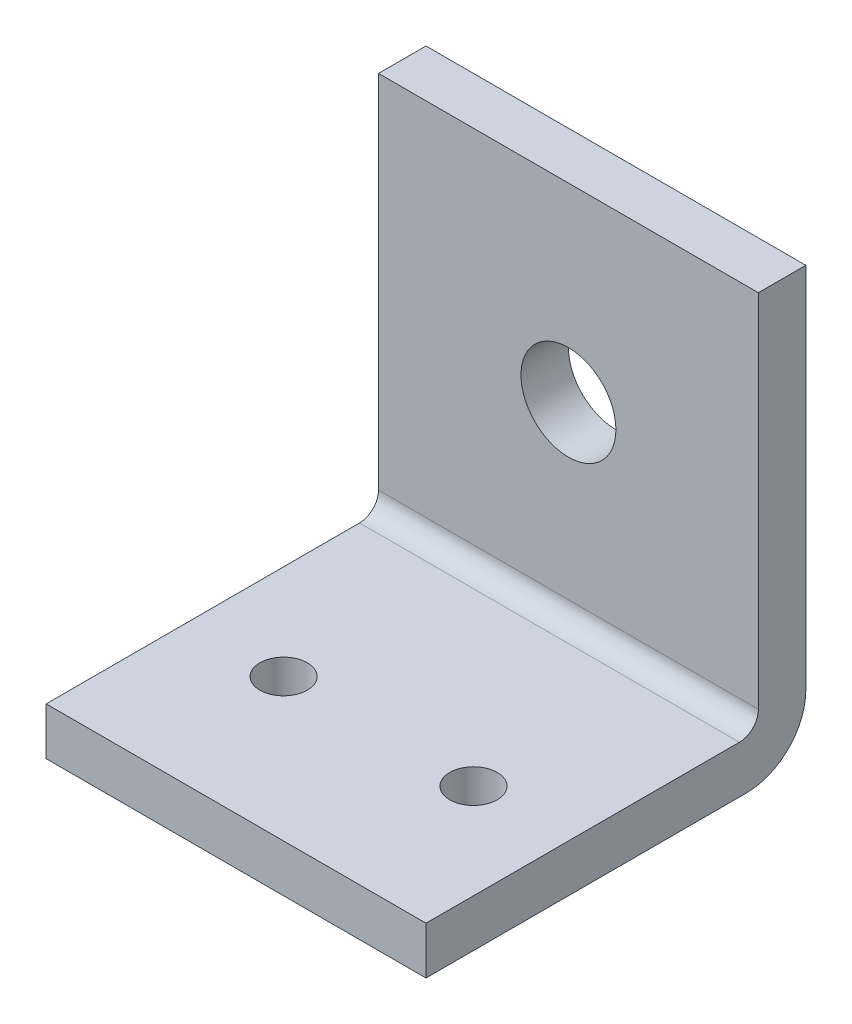
ISO-10303-21;
HEADER;
FILE_DESCRIPTION(('STEP AP214'),'2;1');
FILE_NAME('part.step','',(''),(''),'','','');
FILE_SCHEMA(('AUTOMOTIVE_DESIGN { 1 0 10303 214 1 1 1 1 }'));
ENDSEC;
DATA;
#1=APPLICATION_CONTEXT('core data for automotive mechanical design processes');
#2=APPLICATION_PROTOCOL_DEFINITION('international standard','automotive_design',2000,#1);
#3=PRODUCT_CONTEXT('',#1,'mechanical');
#4=PRODUCT('Part','Part','',(#3));
#5=PRODUCT_RELATED_PRODUCT_CATEGORY('part','',(#4));
#6=PRODUCT_DEFINITION_FORMATION('','',#4);
#7=PRODUCT_DEFINITION_CONTEXT('part definition',#1,'design');
#8=PRODUCT_DEFINITION('design','',#6,#7);
#9=PRODUCT_DEFINITION_SHAPE('','',#8);
#10=(LENGTH_UNIT() NAMED_UNIT(*) SI_UNIT(.MILLI.,.METRE.));
#11=(NAMED_UNIT(*) PLANE_ANGLE_UNIT() SI_UNIT($,.RADIAN.));
#12=(NAMED_UNIT(*) SI_UNIT($,.STERADIAN.) SOLID_ANGLE_UNIT());
#13=UNCERTAINTY_MEASURE_WITH_UNIT(LENGTH_MEASURE(1.E-05),#10,'distance_accuracy_value','');
#14=(GEOMETRIC_REPRESENTATION_CONTEXT(3) GLOBAL_UNCERTAINTY_ASSIGNED_CONTEXT((#13)) GLOBAL_UNIT_ASSIGNED_CONTEXT((#10,
#11,#12)) REPRESENTATION_CONTEXT('',''));
#15=CARTESIAN_POINT('',(0.,0.,0.));
#16=DIRECTION('',(0.,0.,1.));
#17=DIRECTION('',(1.,0.,0.));
#18=AXIS2_PLACEMENT_3D('',#15,#16,#17);
#19=CARTESIAN_POINT('',(0.,5.,40.));
#20=DIRECTION('',(0.,-1.,0.));
#21=DIRECTION('',(0.,0.,-1.));
#22=AXIS2_PLACEMENT_3D('',#19,#20,#21);
#23=PLANE('',#22);
#24=CARTESIAN_POINT('',(10.,5.,25.));
#25=DIRECTION('',(0.,1.,0.));
#26=DIRECTION('',(0.,0.,1.));
#27=AXIS2_PLACEMENT_3D('',#24,#25,#26);
#28=CIRCLE('',#27,2.5);
#29=CARTESIAN_POINT('',(10.,5.,27.5));
#30=VERTEX_POINT('',#29);
#31=EDGE_CURVE('E182',#30,#30,#28,.T.);
#32=ORIENTED_EDGE('',*,*,#31,.F.);
#33=EDGE_LOOP('',(#32));
#34=FACE_BOUND('',#33,.T.);
#35=CARTESIAN_POINT('',(30.,5.,25.));
#36=DIRECTION('',(0.,1.,0.));
#37=DIRECTION('',(0.,0.,1.));
#38=AXIS2_PLACEMENT_3D('',#35,#36,#37);
#39=CIRCLE('',#38,2.5);
#40=CARTESIAN_POINT('',(30.,5.,27.5));
#41=VERTEX_POINT('',#40);
#42=EDGE_CURVE('E204',#41,#41,#39,.T.);
#43=ORIENTED_EDGE('',*,*,#42,.F.);
#44=EDGE_LOOP('',(#43));
#45=FACE_BOUND('',#44,.T.);
#46=DIRECTION('',(0.,0.,-1.));
#47=VECTOR('',#46,1.);
#48=CARTESIAN_POINT('',(40.,5.,40.));
#49=LINE('',#48,#47);
#50=CARTESIAN_POINT('',(40.,5.,40.));
#51=VERTEX_POINT('',#50);
#52=CARTESIAN_POINT('',(40.,5.,7.));
#53=VERTEX_POINT('',#52);
#54=EDGE_CURVE('E166',#51,#53,#49,.T.);
#55=ORIENTED_EDGE('',*,*,#54,.T.);
#56=DIRECTION('',(1.,0.,0.));
#57=VECTOR('',#56,1.);
#58=CARTESIAN_POINT('',(0.,5.,7.));
#59=LINE('',#58,#57);
#60=CARTESIAN_POINT('',(0.,5.,7.));
#61=VERTEX_POINT('',#60);
#62=EDGE_CURVE('E65',#53,#61,#59,.F.);
#63=ORIENTED_EDGE('',*,*,#62,.T.);
#64=DIRECTION('',(0.,0.,-1.));
#65=VECTOR('',#64,1.);
#66=CARTESIAN_POINT('',(0.,5.,40.));
#67=LINE('',#66,#65);
#68=CARTESIAN_POINT('',(0.,5.,40.));
#69=VERTEX_POINT('',#68);
#70=EDGE_CURVE('E160',#69,#61,#67,.T.);
#71=ORIENTED_EDGE('',*,*,#70,.F.);
#72=DIRECTION('',(-1.,0.,0.));
#73=VECTOR('',#72,1.);
#74=CARTESIAN_POINT('',(0.,5.,40.));
#75=LINE('',#74,#73);
#76=EDGE_CURVE('E158',#51,#69,#75,.T.);
#77=ORIENTED_EDGE('',*,*,#76,.F.);
#78=EDGE_LOOP('',(#55,#63,#71,#77));
#79=FACE_BOUND('',#78,.T.);
#80=ADVANCED_FACE('F43',(#34,#45,#79),#23,.F.);
#81=CARTESIAN_POINT('',(0.,0.,40.));
#82=DIRECTION('',(1.,0.,0.));
#83=DIRECTION('',(0.,0.,-1.));
#84=AXIS2_PLACEMENT_3D('',#81,#82,#83);
#85=PLANE('',#84);
#86=DIRECTION('',(0.,-1.,0.));
#87=VECTOR('',#86,1.);
#88=CARTESIAN_POINT('',(0.,0.,0.));
#89=LINE('',#88,#87);
#90=CARTESIAN_POINT('',(0.,45.,0.));
#91=VERTEX_POINT('',#90);
#92=CARTESIAN_POINT('',(0.,6.25,0.));
#93=VERTEX_POINT('',#92);
#94=EDGE_CURVE('E137',#91,#93,#89,.T.);
#95=ORIENTED_EDGE('',*,*,#94,.T.);
#96=CARTESIAN_POINT('',(0.,6.25,6.25));
#97=DIRECTION('',(1.,0.,0.));
#98=DIRECTION('',(0.,0.,-1.));
#99=AXIS2_PLACEMENT_3D('',#96,#97,#98);
#100=CIRCLE('',#99,6.25);
#101=CARTESIAN_POINT('',(0.,0.,6.25));
#102=VERTEX_POINT('',#101);
#103=EDGE_CURVE('E195',#93,#102,#100,.F.);
#104=ORIENTED_EDGE('',*,*,#103,.T.);
#105=DIRECTION('',(0.,0.,-1.));
#106=VECTOR('',#105,1.);
#107=CARTESIAN_POINT('',(0.,0.,40.));
#108=LINE('',#107,#106);
#109=CARTESIAN_POINT('',(0.,0.,40.));
#110=VERTEX_POINT('',#109);
#111=EDGE_CURVE('E173',#110,#102,#108,.T.);
#112=ORIENTED_EDGE('',*,*,#111,.F.);
#113=DIRECTION('',(0.,-1.,0.));
#114=VECTOR('',#113,1.);
#115=CARTESIAN_POINT('',(0.,0.,40.));
#116=LINE('',#115,#114);
#117=EDGE_CURVE('E148',#69,#110,#116,.T.);
#118=ORIENTED_EDGE('',*,*,#117,.F.);
#119=ORIENTED_EDGE('',*,*,#70,.T.);
#120=CARTESIAN_POINT('',(0.,7.,7.));
#121=DIRECTION('',(1.,0.,0.));
#122=DIRECTION('',(0.,0.,-1.));
#123=AXIS2_PLACEMENT_3D('',#120,#121,#122);
#124=CIRCLE('',#123,2.);
#125=CARTESIAN_POINT('',(0.,7.,5.));
#126=VERTEX_POINT('',#125);
#127=EDGE_CURVE('E11',#61,#126,#124,.T.);
#128=ORIENTED_EDGE('',*,*,#127,.T.);
#129=DIRECTION('',(0.,-1.,0.));
#130=VECTOR('',#129,1.);
#131=CARTESIAN_POINT('',(0.,45.,5.));
#132=LINE('',#131,#130);
#133=CARTESIAN_POINT('',(0.,45.,5.));
#134=VERTEX_POINT('',#133);
#135=EDGE_CURVE('E114',#134,#126,#132,.T.);
#136=ORIENTED_EDGE('',*,*,#135,.F.);
#137=DIRECTION('',(0.,0.,1.));
#138=VECTOR('',#137,1.);
#139=CARTESIAN_POINT('',(0.,45.,0.));
#140=LINE('',#139,#138);
#141=EDGE_CURVE('E122',#91,#134,#140,.T.);
#142=ORIENTED_EDGE('',*,*,#141,.F.);
#143=EDGE_LOOP('',(#95,#104,#112,#118,#119,#128,#136,#142));
#144=FACE_BOUND('',#143,.T.);
#145=ADVANCED_FACE('F134',(#144),#85,.F.);
#146=CARTESIAN_POINT('',(0.,0.,40.));
#147=DIRECTION('',(0.,1.,0.));
#148=DIRECTION('',(0.,0.,1.));
#149=AXIS2_PLACEMENT_3D('',#146,#147,#148);
#150=PLANE('',#149);
#151=CARTESIAN_POINT('',(10.,0.,25.));
#152=DIRECTION('',(0.,1.,0.));
#153=DIRECTION('',(0.,0.,1.));
#154=AXIS2_PLACEMENT_3D('',#151,#152,#153);
#155=CIRCLE('',#154,2.5);
#156=CARTESIAN_POINT('',(10.,0.,27.5));
#157=VERTEX_POINT('',#156);
#158=EDGE_CURVE('E132',#157,#157,#155,.T.);
#159=ORIENTED_EDGE('',*,*,#158,.T.);
#160=EDGE_LOOP('',(#159));
#161=FACE_BOUND('',#160,.T.);
#162=CARTESIAN_POINT('',(30.,0.,25.));
#163=DIRECTION('',(0.,1.,0.));
#164=DIRECTION('',(0.,0.,1.));
#165=AXIS2_PLACEMENT_3D('',#162,#163,#164);
#166=CIRCLE('',#165,2.5);
#167=CARTESIAN_POINT('',(30.,0.,27.5));
#168=VERTEX_POINT('',#167);
#169=EDGE_CURVE('E178',#168,#168,#166,.T.);
#170=ORIENTED_EDGE('',*,*,#169,.T.);
#171=EDGE_LOOP('',(#170));
#172=FACE_BOUND('',#171,.T.);
#173=ORIENTED_EDGE('',*,*,#111,.T.);
#174=DIRECTION('',(1.,0.,0.));
#175=VECTOR('',#174,1.);
#176=CARTESIAN_POINT('',(40.,0.,6.25));
#177=LINE('',#176,#175);
#178=CARTESIAN_POINT('',(40.,0.,6.25));
#179=VERTEX_POINT('',#178);
#180=EDGE_CURVE('E177',#102,#179,#177,.T.);
#181=ORIENTED_EDGE('',*,*,#180,.T.);
#182=DIRECTION('',(0.,0.,-1.));
#183=VECTOR('',#182,1.);
#184=CARTESIAN_POINT('',(40.,0.,40.));
#185=LINE('',#184,#183);
#186=CARTESIAN_POINT('',(40.,0.,40.));
#187=VERTEX_POINT('',#186);
#188=EDGE_CURVE('E169',#187,#179,#185,.T.);
#189=ORIENTED_EDGE('',*,*,#188,.F.);
#190=DIRECTION('',(1.,0.,0.));
#191=VECTOR('',#190,1.);
#192=CARTESIAN_POINT('',(0.,0.,40.));
#193=LINE('',#192,#191);
#194=EDGE_CURVE('E152',#110,#187,#193,.T.);
#195=ORIENTED_EDGE('',*,*,#194,.F.);
#196=EDGE_LOOP('',(#173,#181,#189,#195));
#197=FACE_BOUND('',#196,.T.);
#198=ADVANCED_FACE('F242',(#161,#172,#197),#150,.F.);
#199=CARTESIAN_POINT('',(40.,0.,40.));
#200=DIRECTION('',(-1.,0.,0.));
#201=DIRECTION('',(0.,0.,1.));
#202=AXIS2_PLACEMENT_3D('',#199,#200,#201);
#203=PLANE('',#202);
#204=ORIENTED_EDGE('',*,*,#188,.T.);
#205=CARTESIAN_POINT('',(40.,6.25,6.25));
#206=DIRECTION('',(-1.,0.,0.));
#207=DIRECTION('',(0.,0.,1.));
#208=AXIS2_PLACEMENT_3D('',#205,#206,#207);
#209=CIRCLE('',#208,6.25);
#210=CARTESIAN_POINT('',(40.,6.25,0.));
#211=VERTEX_POINT('',#210);
#212=EDGE_CURVE('E189',#179,#211,#209,.F.);
#213=ORIENTED_EDGE('',*,*,#212,.T.);
#214=DIRECTION('',(0.,1.,0.));
#215=VECTOR('',#214,1.);
#216=CARTESIAN_POINT('',(40.,0.,0.));
#217=LINE('',#216,#215);
#218=CARTESIAN_POINT('',(40.,45.,0.));
#219=VERTEX_POINT('',#218);
#220=EDGE_CURVE('E142',#211,#219,#217,.T.);
#221=ORIENTED_EDGE('',*,*,#220,.T.);
#222=DIRECTION('',(0.,0.,-1.));
#223=VECTOR('',#222,1.);
#224=CARTESIAN_POINT('',(40.,45.,0.));
#225=LINE('',#224,#223);
#226=CARTESIAN_POINT('',(40.,45.,5.));
#227=VERTEX_POINT('',#226);
#228=EDGE_CURVE('E121',#227,#219,#225,.T.);
#229=ORIENTED_EDGE('',*,*,#228,.F.);
#230=DIRECTION('',(0.,-1.,0.));
#231=VECTOR('',#230,1.);
#232=CARTESIAN_POINT('',(40.,45.,5.));
#233=LINE('',#232,#231);
#234=CARTESIAN_POINT('',(40.,7.,5.));
#235=VERTEX_POINT('',#234);
#236=EDGE_CURVE('E116',#227,#235,#233,.T.);
#237=ORIENTED_EDGE('',*,*,#236,.T.);
#238=CARTESIAN_POINT('',(40.,7.,7.));
#239=DIRECTION('',(-1.,0.,0.));
#240=DIRECTION('',(0.,0.,1.));
#241=AXIS2_PLACEMENT_3D('',#238,#239,#240);
#242=CIRCLE('',#241,2.);
#243=EDGE_CURVE('E52',#235,#53,#242,.T.);
#244=ORIENTED_EDGE('',*,*,#243,.T.);
#245=ORIENTED_EDGE('',*,*,#54,.F.);
#246=DIRECTION('',(0.,1.,0.));
#247=VECTOR('',#246,1.);
#248=CARTESIAN_POINT('',(40.,0.,40.));
#249=LINE('',#248,#247);
#250=EDGE_CURVE('E155',#187,#51,#249,.T.);
#251=ORIENTED_EDGE('',*,*,#250,.F.);
#252=EDGE_LOOP('',(#204,#213,#221,#229,#237,#244,#245,#251));
#253=FACE_BOUND('',#252,.T.);
#254=ADVANCED_FACE('F247',(#253),#203,.F.);
#255=CARTESIAN_POINT('',(0.,0.,40.));
#256=DIRECTION('',(0.,0.,-1.));
#257=DIRECTION('',(-1.,0.,0.));
#258=AXIS2_PLACEMENT_3D('',#255,#256,#257);
#259=PLANE('',#258);
#260=ORIENTED_EDGE('',*,*,#117,.T.);
#261=ORIENTED_EDGE('',*,*,#194,.T.);
#262=ORIENTED_EDGE('',*,*,#250,.T.);
#263=ORIENTED_EDGE('',*,*,#76,.T.);
#264=EDGE_LOOP('',(#260,#261,#262,#263));
#265=FACE_BOUND('',#264,.T.);
#266=ADVANCED_FACE('F233',(#265),#259,.F.);
#267=CARTESIAN_POINT('',(0.,0.,0.));
#268=DIRECTION('',(0.,0.,-1.));
#269=DIRECTION('',(-1.,0.,0.));
#270=AXIS2_PLACEMENT_3D('',#267,#268,#269);
#271=PLANE('',#270);
#272=CARTESIAN_POINT('',(20.,25.,0.));
#273=DIRECTION('',(0.,0.,-1.));
#274=DIRECTION('',(-1.,0.,0.));
#275=AXIS2_PLACEMENT_3D('',#272,#273,#274);
#276=CIRCLE('',#275,5.);
#277=CARTESIAN_POINT('',(15.,25.,0.));
#278=VERTEX_POINT('',#277);
#279=EDGE_CURVE('E206',#278,#278,#276,.T.);
#280=ORIENTED_EDGE('',*,*,#279,.F.);
#281=EDGE_LOOP('',(#280));
#282=FACE_BOUND('',#281,.T.);
#283=ORIENTED_EDGE('',*,*,#220,.F.);
#284=DIRECTION('',(1.,0.,0.));
#285=VECTOR('',#284,1.);
#286=CARTESIAN_POINT('',(0.,6.25,0.));
#287=LINE('',#286,#285);
#288=EDGE_CURVE('E192',#211,#93,#287,.F.);
#289=ORIENTED_EDGE('',*,*,#288,.T.);
#290=ORIENTED_EDGE('',*,*,#94,.F.);
#291=DIRECTION('',(-1.,0.,0.));
#292=VECTOR('',#291,1.);
#293=CARTESIAN_POINT('',(0.,45.,0.));
#294=LINE('',#293,#292);
#295=EDGE_CURVE('E128',#219,#91,#294,.T.);
#296=ORIENTED_EDGE('',*,*,#295,.F.);
#297=EDGE_LOOP('',(#283,#289,#290,#296));
#298=FACE_BOUND('',#297,.T.);
#299=ADVANCED_FACE('F226',(#282,#298),#271,.T.);
#300=CARTESIAN_POINT('',(0.,45.,5.));
#301=DIRECTION('',(0.,0.,-1.));
#302=DIRECTION('',(-1.,0.,0.));
#303=AXIS2_PLACEMENT_3D('',#300,#301,#302);
#304=PLANE('',#303);
#305=CARTESIAN_POINT('',(20.,25.,5.));
#306=DIRECTION('',(0.,0.,1.));
#307=DIRECTION('',(1.,0.,0.));
#308=AXIS2_PLACEMENT_3D('',#305,#306,#307);
#309=CIRCLE('',#308,5.);
#310=CARTESIAN_POINT('',(25.,25.,5.));
#311=VERTEX_POINT('',#310);
#312=EDGE_CURVE('E214',#311,#311,#309,.T.);
#313=ORIENTED_EDGE('',*,*,#312,.F.);
#314=EDGE_LOOP('',(#313));
#315=FACE_BOUND('',#314,.T.);
#316=ORIENTED_EDGE('',*,*,#135,.T.);
#317=DIRECTION('',(1.,0.,0.));
#318=VECTOR('',#317,1.);
#319=CARTESIAN_POINT('',(40.,7.,5.));
#320=LINE('',#319,#318);
#321=EDGE_CURVE('E198',#126,#235,#320,.T.);
#322=ORIENTED_EDGE('',*,*,#321,.T.);
#323=ORIENTED_EDGE('',*,*,#236,.F.);
#324=DIRECTION('',(1.,0.,0.));
#325=VECTOR('',#324,1.);
#326=CARTESIAN_POINT('',(0.,45.,5.));
#327=LINE('',#326,#325);
#328=EDGE_CURVE('E109',#134,#227,#327,.T.);
#329=ORIENTED_EDGE('',*,*,#328,.F.);
#330=EDGE_LOOP('',(#316,#322,#323,#329));
#331=FACE_BOUND('',#330,.T.);
#332=ADVANCED_FACE('F111',(#315,#331),#304,.F.);
#333=CARTESIAN_POINT('',(0.,45.,0.));
#334=DIRECTION('',(0.,1.,0.));
#335=DIRECTION('',(0.,0.,1.));
#336=AXIS2_PLACEMENT_3D('',#333,#334,#335);
#337=PLANE('',#336);
#338=ORIENTED_EDGE('',*,*,#141,.T.);
#339=ORIENTED_EDGE('',*,*,#328,.T.);
#340=ORIENTED_EDGE('',*,*,#228,.T.);
#341=ORIENTED_EDGE('',*,*,#295,.T.);
#342=EDGE_LOOP('',(#338,#339,#340,#341));
#343=FACE_BOUND('',#342,.T.);
#344=ADVANCED_FACE('F126',(#343),#337,.T.);
#345=CARTESIAN_POINT('',(30.,-5.,25.));
#346=DIRECTION('',(0.,1.,0.));
#347=DIRECTION('',(0.,0.,1.));
#348=AXIS2_PLACEMENT_3D('',#345,#346,#347);
#349=CYLINDRICAL_SURFACE('',#348,2.5);
#350=ORIENTED_EDGE('',*,*,#42,.T.);
#351=EDGE_LOOP('',(#350));
#352=FACE_BOUND('',#351,.T.);
#353=ORIENTED_EDGE('',*,*,#169,.F.);
#354=EDGE_LOOP('',(#353));
#355=FACE_BOUND('',#354,.T.);
#356=ADVANCED_FACE('F231',(#352,#355),#349,.F.);
#357=CARTESIAN_POINT('',(10.,-5.,25.));
#358=DIRECTION('',(0.,1.,0.));
#359=DIRECTION('',(0.,0.,1.));
#360=AXIS2_PLACEMENT_3D('',#357,#358,#359);
#361=CYLINDRICAL_SURFACE('',#360,2.5);
#362=ORIENTED_EDGE('',*,*,#31,.T.);
#363=EDGE_LOOP('',(#362));
#364=FACE_BOUND('',#363,.T.);
#365=ORIENTED_EDGE('',*,*,#158,.F.);
#366=EDGE_LOOP('',(#365));
#367=FACE_BOUND('',#366,.T.);
#368=ADVANCED_FACE('F259',(#364,#367),#361,.F.);
#369=CARTESIAN_POINT('',(20.,25.,-5.));
#370=DIRECTION('',(0.,0.,1.));
#371=DIRECTION('',(1.,0.,0.));
#372=AXIS2_PLACEMENT_3D('',#369,#370,#371);
#373=CYLINDRICAL_SURFACE('',#372,5.);
#374=ORIENTED_EDGE('',*,*,#279,.T.);
#375=EDGE_LOOP('',(#374));
#376=FACE_BOUND('',#375,.T.);
#377=ORIENTED_EDGE('',*,*,#312,.T.);
#378=EDGE_LOOP('',(#377));
#379=FACE_BOUND('',#378,.T.);
#380=ADVANCED_FACE('F223',(#376,#379),#373,.F.);
#381=CARTESIAN_POINT('',(0.,6.25,6.25));
#382=DIRECTION('',(-1.,0.,0.));
#383=DIRECTION('',(0.,0.,1.));
#384=AXIS2_PLACEMENT_3D('',#381,#382,#383);
#385=CYLINDRICAL_SURFACE('',#384,6.25);
#386=ORIENTED_EDGE('',*,*,#103,.F.);
#387=ORIENTED_EDGE('',*,*,#288,.F.);
#388=ORIENTED_EDGE('',*,*,#212,.F.);
#389=ORIENTED_EDGE('',*,*,#180,.F.);
#390=EDGE_LOOP('',(#386,#387,#388,#389));
#391=FACE_BOUND('',#390,.T.);
#392=ADVANCED_FACE('F252',(#391),#385,.T.);
#393=CARTESIAN_POINT('',(0.,7.,7.));
#394=DIRECTION('',(-1.,0.,0.));
#395=DIRECTION('',(0.,0.,1.));
#396=AXIS2_PLACEMENT_3D('',#393,#394,#395);
#397=CYLINDRICAL_SURFACE('',#396,2.);
#398=ORIENTED_EDGE('',*,*,#127,.F.);
#399=ORIENTED_EDGE('',*,*,#62,.F.);
#400=ORIENTED_EDGE('',*,*,#243,.F.);
#401=ORIENTED_EDGE('',*,*,#321,.F.);
#402=EDGE_LOOP('',(#398,#399,#400,#401));
#403=FACE_BOUND('',#402,.T.);
#404=ADVANCED_FACE('F45',(#403),#397,.F.);
#405=CLOSED_SHELL('',(#80,#145,#198,#254,#266,#299,#332,#344,#356,#368,#380,#392,#404));
#406=MANIFOLD_SOLID_BREP('B2',#405);
#407=ADVANCED_BREP_SHAPE_REPRESENTATION('',(#18,#406),#14);
#408=SHAPE_DEFINITION_REPRESENTATION(#9,#407);
ENDSEC;
END-ISO-10303-21;
